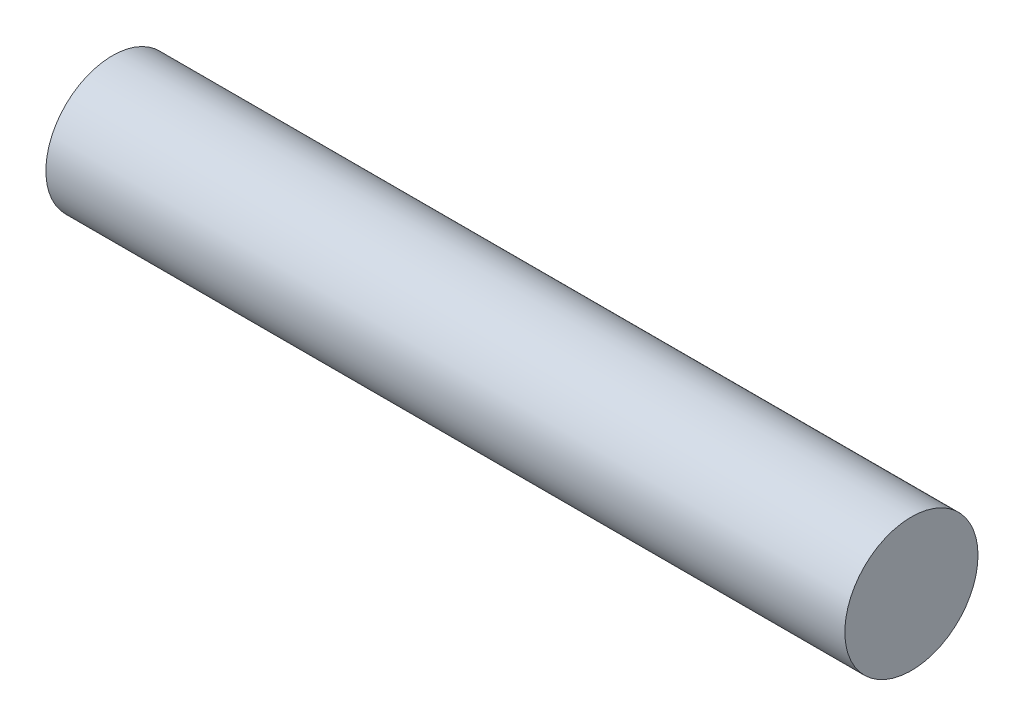
ISO-10303-21;
HEADER;
FILE_DESCRIPTION(('STEP AP214'),'2;1');
FILE_NAME('part.step','',(''),(''),'','','');
FILE_SCHEMA(('AUTOMOTIVE_DESIGN { 1 0 10303 214 1 1 1 1 }'));
ENDSEC;
DATA;
#1=APPLICATION_CONTEXT('core data for automotive mechanical design processes');
#2=APPLICATION_PROTOCOL_DEFINITION('international standard','automotive_design',2000,#1);
#3=PRODUCT_CONTEXT('',#1,'mechanical');
#4=PRODUCT('Part','Part','',(#3));
#5=PRODUCT_RELATED_PRODUCT_CATEGORY('part','',(#4));
#6=PRODUCT_DEFINITION_FORMATION('','',#4);
#7=PRODUCT_DEFINITION_CONTEXT('part definition',#1,'design');
#8=PRODUCT_DEFINITION('design','',#6,#7);
#9=PRODUCT_DEFINITION_SHAPE('','',#8);
#10=(LENGTH_UNIT() NAMED_UNIT(*) SI_UNIT(.MILLI.,.METRE.));
#11=(NAMED_UNIT(*) PLANE_ANGLE_UNIT() SI_UNIT($,.RADIAN.));
#12=(NAMED_UNIT(*) SI_UNIT($,.STERADIAN.) SOLID_ANGLE_UNIT());
#13=UNCERTAINTY_MEASURE_WITH_UNIT(LENGTH_MEASURE(1.E-05),#10,'distance_accuracy_value','');
#14=(GEOMETRIC_REPRESENTATION_CONTEXT(3) GLOBAL_UNCERTAINTY_ASSIGNED_CONTEXT((#13)) GLOBAL_UNIT_ASSIGNED_CONTEXT((#10,
#11,#12)) REPRESENTATION_CONTEXT('',''));
#15=CARTESIAN_POINT('',(0.,0.,0.));
#16=DIRECTION('',(0.,0.,1.));
#17=DIRECTION('',(1.,0.,0.));
#18=AXIS2_PLACEMENT_3D('',#15,#16,#17);
#19=CARTESIAN_POINT('',(76.2,0.,0.));
#20=DIRECTION('',(-1.,0.,0.));
#21=DIRECTION('',(0.,0.,1.));
#22=AXIS2_PLACEMENT_3D('',#19,#20,#21);
#23=CYLINDRICAL_SURFACE('',#22,6.35);
#24=CARTESIAN_POINT('',(76.2,0.,0.));
#25=DIRECTION('',(1.,0.,0.));
#26=DIRECTION('',(0.,0.,-1.));
#27=AXIS2_PLACEMENT_3D('',#24,#25,#26);
#28=CIRCLE('',#27,6.35);
#29=CARTESIAN_POINT('',(76.2,0.,-6.35));
#30=VERTEX_POINT('',#29);
#31=EDGE_CURVE('E10',#30,#30,#28,.T.);
#32=ORIENTED_EDGE('',*,*,#31,.F.);
#33=EDGE_LOOP('',(#32));
#34=FACE_BOUND('',#33,.T.);
#35=CARTESIAN_POINT('',(0.,0.,0.));
#36=DIRECTION('',(1.,0.,0.));
#37=DIRECTION('',(0.,0.,-1.));
#38=AXIS2_PLACEMENT_3D('',#35,#36,#37);
#39=CIRCLE('',#38,6.35);
#40=CARTESIAN_POINT('',(0.,0.,-6.35));
#41=VERTEX_POINT('',#40);
#42=EDGE_CURVE('E36',#41,#41,#39,.T.);
#43=ORIENTED_EDGE('',*,*,#42,.T.);
#44=EDGE_LOOP('',(#43));
#45=FACE_BOUND('',#44,.T.);
#46=ADVANCED_FACE('F33',(#34,#45),#23,.T.);
#47=CARTESIAN_POINT('',(76.2,0.,0.));
#48=DIRECTION('',(1.,0.,0.));
#49=DIRECTION('',(0.,0.,-1.));
#50=AXIS2_PLACEMENT_3D('',#47,#48,#49);
#51=PLANE('',#50);
#52=ORIENTED_EDGE('',*,*,#31,.T.);
#53=EDGE_LOOP('',(#52));
#54=FACE_BOUND('',#53,.T.);
#55=ADVANCED_FACE('F48',(#54),#51,.T.);
#56=CARTESIAN_POINT('',(0.,0.,0.));
#57=DIRECTION('',(1.,0.,0.));
#58=DIRECTION('',(0.,0.,-1.));
#59=AXIS2_PLACEMENT_3D('',#56,#57,#58);
#60=PLANE('',#59);
#61=ORIENTED_EDGE('',*,*,#42,.F.);
#62=EDGE_LOOP('',(#61));
#63=FACE_BOUND('',#62,.T.);
#64=ADVANCED_FACE('F46',(#63),#60,.F.);
#65=CLOSED_SHELL('',(#46,#55,#64));
#66=MANIFOLD_SOLID_BREP('B2',#65);
#67=ADVANCED_BREP_SHAPE_REPRESENTATION('',(#18,#66),#14);
#68=SHAPE_DEFINITION_REPRESENTATION(#9,#67);
ENDSEC;
END-ISO-10303-21;
